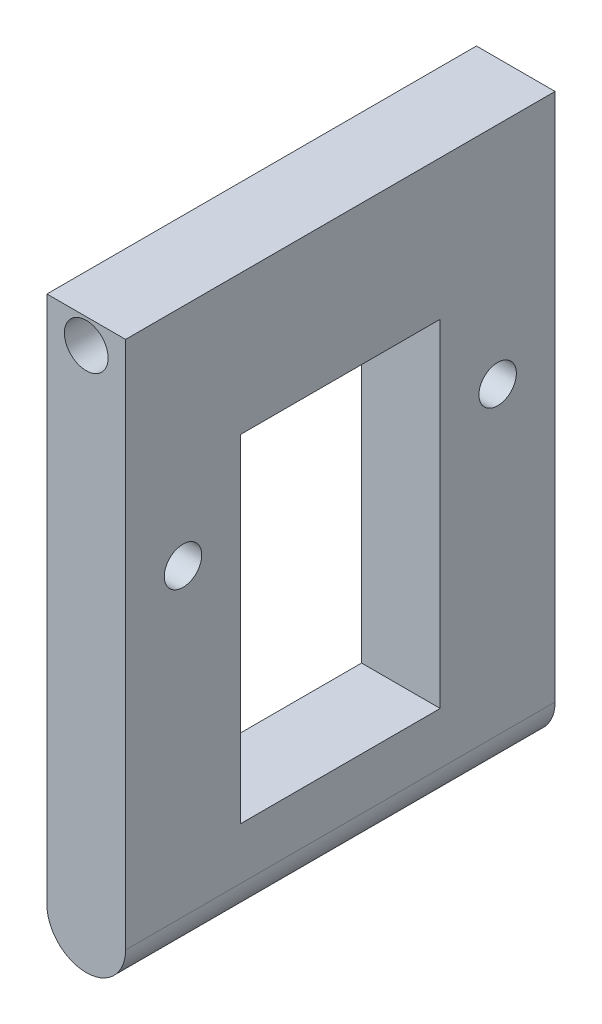
ISO-10303-21;
HEADER;
FILE_DESCRIPTION(('STEP AP214'),'2;1');
FILE_NAME('part.step','',(''),(''),'','','');
FILE_SCHEMA(('AUTOMOTIVE_DESIGN { 1 0 10303 214 1 1 1 1 }'));
ENDSEC;
DATA;
#1=APPLICATION_CONTEXT('core data for automotive mechanical design processes');
#2=APPLICATION_PROTOCOL_DEFINITION('international standard','automotive_design',2000,#1);
#3=PRODUCT_CONTEXT('',#1,'mechanical');
#4=PRODUCT('Part','Part','',(#3));
#5=PRODUCT_RELATED_PRODUCT_CATEGORY('part','',(#4));
#6=PRODUCT_DEFINITION_FORMATION('','',#4);
#7=PRODUCT_DEFINITION_CONTEXT('part definition',#1,'design');
#8=PRODUCT_DEFINITION('design','',#6,#7);
#9=PRODUCT_DEFINITION_SHAPE('','',#8);
#10=(LENGTH_UNIT() NAMED_UNIT(*) SI_UNIT(.MILLI.,.METRE.));
#11=(NAMED_UNIT(*) PLANE_ANGLE_UNIT() SI_UNIT($,.RADIAN.));
#12=(NAMED_UNIT(*) SI_UNIT($,.STERADIAN.) SOLID_ANGLE_UNIT());
#13=UNCERTAINTY_MEASURE_WITH_UNIT(LENGTH_MEASURE(1.E-05),#10,'distance_accuracy_value','');
#14=(GEOMETRIC_REPRESENTATION_CONTEXT(3) GLOBAL_UNCERTAINTY_ASSIGNED_CONTEXT((#13)) GLOBAL_UNIT_ASSIGNED_CONTEXT((#10,
#11,#12)) REPRESENTATION_CONTEXT('',''));
#15=CARTESIAN_POINT('',(0.,0.,0.));
#16=DIRECTION('',(0.,0.,1.));
#17=DIRECTION('',(1.,0.,0.));
#18=AXIS2_PLACEMENT_3D('',#15,#16,#17);
#19=CARTESIAN_POINT('',(3.15,-30.9323361823362,14.2108262108262));
#20=DIRECTION('',(0.,0.,-1.));
#21=DIRECTION('',(-1.,0.,0.));
#22=AXIS2_PLACEMENT_3D('',#19,#20,#21);
#23=CYLINDRICAL_SURFACE('',#22,3.15);
#24=DIRECTION('',(0.,0.,1.));
#25=VECTOR('',#24,1.);
#26=CARTESIAN_POINT('',(6.3,-30.9323361823362,14.2108262108262));
#27=LINE('',#26,#25);
#28=CARTESIAN_POINT('',(6.3,-30.9323361823362,14.2108262108262));
#29=VERTEX_POINT('',#28);
#30=CARTESIAN_POINT('',(6.3,-30.9323361823362,-20.1891737891738));
#31=VERTEX_POINT('',#30);
#32=EDGE_CURVE('E166',#29,#31,#27,.F.);
#33=ORIENTED_EDGE('',*,*,#32,.F.);
#34=CARTESIAN_POINT('',(3.15,-30.9323361823362,14.2108262108262));
#35=DIRECTION('',(0.,0.,-1.));
#36=DIRECTION('',(0.,1.,0.));
#37=AXIS2_PLACEMENT_3D('',#34,#35,#36);
#38=CIRCLE('',#37,3.15);
#39=CARTESIAN_POINT('',(0.,-30.9323361823362,14.2108262108262));
#40=VERTEX_POINT('',#39);
#41=EDGE_CURVE('E45',#40,#29,#38,.F.);
#42=ORIENTED_EDGE('',*,*,#41,.F.);
#43=DIRECTION('',(0.,0.,-1.));
#44=VECTOR('',#43,1.);
#45=CARTESIAN_POINT('',(0.,-30.9323361823362,0.));
#46=LINE('',#45,#44);
#47=CARTESIAN_POINT('',(0.,-30.9323361823362,-20.1891737891738));
#48=VERTEX_POINT('',#47);
#49=EDGE_CURVE('E171',#48,#40,#46,.F.);
#50=ORIENTED_EDGE('',*,*,#49,.F.);
#51=CARTESIAN_POINT('',(3.15,-30.9323361823362,-20.1891737891738));
#52=DIRECTION('',(0.,0.,1.));
#53=DIRECTION('',(0.,-1.,0.));
#54=AXIS2_PLACEMENT_3D('',#51,#52,#53);
#55=CIRCLE('',#54,3.15);
#56=EDGE_CURVE('E11',#31,#48,#55,.F.);
#57=ORIENTED_EDGE('',*,*,#56,.F.);
#58=EDGE_LOOP('',(#33,#42,#50,#57));
#59=FACE_BOUND('',#58,.T.);
#60=ADVANCED_FACE('F36',(#59),#23,.T.);
#61=CARTESIAN_POINT('',(6.3,11.4176638176638,14.2108262108262));
#62=DIRECTION('',(0.,0.,-1.));
#63=DIRECTION('',(0.,1.,0.));
#64=AXIS2_PLACEMENT_3D('',#61,#62,#63);
#65=PLANE('',#64);
#66=CARTESIAN_POINT('',(3.15,9.41766381766382,14.2108262108262));
#67=DIRECTION('',(0.,0.,1.));
#68=DIRECTION('',(1.,0.,0.));
#69=AXIS2_PLACEMENT_3D('',#66,#67,#68);
#70=CIRCLE('',#69,1.75);
#71=CARTESIAN_POINT('',(4.9,9.41766381766382,14.2108262108262));
#72=VERTEX_POINT('',#71);
#73=EDGE_CURVE('E130',#72,#72,#70,.T.);
#74=ORIENTED_EDGE('',*,*,#73,.F.);
#75=EDGE_LOOP('',(#74));
#76=FACE_BOUND('',#75,.T.);
#77=DIRECTION('',(0.,-1.,0.));
#78=VECTOR('',#77,1.);
#79=CARTESIAN_POINT('',(0.,11.4176638176638,14.2108262108262));
#80=LINE('',#79,#78);
#81=CARTESIAN_POINT('',(0.,11.4176638176638,14.2108262108262));
#82=VERTEX_POINT('',#81);
#83=EDGE_CURVE('E143',#82,#40,#80,.T.);
#84=ORIENTED_EDGE('',*,*,#83,.T.);
#85=ORIENTED_EDGE('',*,*,#41,.T.);
#86=DIRECTION('',(0.,-1.,0.));
#87=VECTOR('',#86,1.);
#88=CARTESIAN_POINT('',(6.3,11.4176638176638,14.2108262108262));
#89=LINE('',#88,#87);
#90=CARTESIAN_POINT('',(6.3,11.4176638176638,14.2108262108262));
#91=VERTEX_POINT('',#90);
#92=EDGE_CURVE('E147',#91,#29,#89,.T.);
#93=ORIENTED_EDGE('',*,*,#92,.F.);
#94=DIRECTION('',(-1.,0.,0.));
#95=VECTOR('',#94,1.);
#96=CARTESIAN_POINT('',(6.3,11.4176638176638,14.2108262108262));
#97=LINE('',#96,#95);
#98=EDGE_CURVE('E155',#91,#82,#97,.T.);
#99=ORIENTED_EDGE('',*,*,#98,.T.);
#100=EDGE_LOOP('',(#84,#85,#93,#99));
#101=FACE_BOUND('',#100,.T.);
#102=ADVANCED_FACE('F175',(#76,#101),#65,.F.);
#103=CARTESIAN_POINT('',(6.3,11.4176638176638,-20.1891737891738));
#104=DIRECTION('',(0.,0.,1.));
#105=DIRECTION('',(0.,-1.,0.));
#106=AXIS2_PLACEMENT_3D('',#103,#104,#105);
#107=PLANE('',#106);
#108=CARTESIAN_POINT('',(3.15,9.41766381766382,-20.1891737891738));
#109=DIRECTION('',(0.,0.,1.));
#110=DIRECTION('',(0.,-1.,0.));
#111=AXIS2_PLACEMENT_3D('',#108,#109,#110);
#112=CIRCLE('',#111,1.75);
#113=CARTESIAN_POINT('',(3.15,7.66766381766382,-20.1891737891738));
#114=VERTEX_POINT('',#113);
#115=EDGE_CURVE('E137',#114,#114,#112,.T.);
#116=ORIENTED_EDGE('',*,*,#115,.T.);
#117=EDGE_LOOP('',(#116));
#118=FACE_BOUND('',#117,.T.);
#119=DIRECTION('',(0.,1.,0.));
#120=VECTOR('',#119,1.);
#121=CARTESIAN_POINT('',(6.3,11.4176638176638,-20.1891737891738));
#122=LINE('',#121,#120);
#123=CARTESIAN_POINT('',(6.3,11.4176638176638,-20.1891737891738));
#124=VERTEX_POINT('',#123);
#125=EDGE_CURVE('E150',#31,#124,#122,.T.);
#126=ORIENTED_EDGE('',*,*,#125,.F.);
#127=ORIENTED_EDGE('',*,*,#56,.T.);
#128=DIRECTION('',(0.,1.,0.));
#129=VECTOR('',#128,1.);
#130=CARTESIAN_POINT('',(0.,11.4176638176638,-20.1891737891738));
#131=LINE('',#130,#129);
#132=CARTESIAN_POINT('',(0.,11.4176638176638,-20.1891737891738));
#133=VERTEX_POINT('',#132);
#134=EDGE_CURVE('E158',#48,#133,#131,.T.);
#135=ORIENTED_EDGE('',*,*,#134,.T.);
#136=DIRECTION('',(-1.,0.,0.));
#137=VECTOR('',#136,1.);
#138=CARTESIAN_POINT('',(6.3,11.4176638176638,-20.1891737891738));
#139=LINE('',#138,#137);
#140=EDGE_CURVE('E163',#124,#133,#139,.T.);
#141=ORIENTED_EDGE('',*,*,#140,.F.);
#142=EDGE_LOOP('',(#126,#127,#135,#141));
#143=FACE_BOUND('',#142,.T.);
#144=ADVANCED_FACE('F186',(#118,#143),#107,.F.);
#145=CARTESIAN_POINT('',(6.3,11.4176638176638,14.2108262108262));
#146=DIRECTION('',(0.,-1.,0.));
#147=DIRECTION('',(0.,0.,-1.));
#148=AXIS2_PLACEMENT_3D('',#145,#146,#147);
#149=PLANE('',#148);
#150=DIRECTION('',(0.,0.,1.));
#151=VECTOR('',#150,1.);
#152=CARTESIAN_POINT('',(0.,11.4176638176638,14.2108262108262));
#153=LINE('',#152,#151);
#154=EDGE_CURVE('E151',#133,#82,#153,.T.);
#155=ORIENTED_EDGE('',*,*,#154,.T.);
#156=ORIENTED_EDGE('',*,*,#98,.F.);
#157=DIRECTION('',(0.,0.,1.));
#158=VECTOR('',#157,1.);
#159=CARTESIAN_POINT('',(6.3,11.4176638176638,14.2108262108262));
#160=LINE('',#159,#158);
#161=EDGE_CURVE('E153',#124,#91,#160,.T.);
#162=ORIENTED_EDGE('',*,*,#161,.F.);
#163=ORIENTED_EDGE('',*,*,#140,.T.);
#164=EDGE_LOOP('',(#155,#156,#162,#163));
#165=FACE_BOUND('',#164,.T.);
#166=ADVANCED_FACE('F183',(#165),#149,.F.);
#167=CARTESIAN_POINT('',(6.3,0.,0.));
#168=DIRECTION('',(1.,0.,0.));
#169=DIRECTION('',(0.,0.,-1.));
#170=AXIS2_PLACEMENT_3D('',#167,#168,#169);
#171=PLANE('',#170);
#172=CARTESIAN_POINT('',(6.3,-6.58233618233618,-15.5891737891738));
#173=DIRECTION('',(1.,0.,0.));
#174=DIRECTION('',(0.,0.,-1.));
#175=AXIS2_PLACEMENT_3D('',#172,#173,#174);
#176=CIRCLE('',#175,1.5);
#177=CARTESIAN_POINT('',(6.3,-6.58233618233618,-17.0891737891738));
#178=VERTEX_POINT('',#177);
#179=EDGE_CURVE('E317',#178,#178,#176,.T.);
#180=ORIENTED_EDGE('',*,*,#179,.F.);
#181=EDGE_LOOP('',(#180));
#182=FACE_BOUND('',#181,.T.);
#183=CARTESIAN_POINT('',(6.3,-6.58233618233618,9.61082621082621));
#184=DIRECTION('',(1.,0.,0.));
#185=DIRECTION('',(0.,0.,-1.));
#186=AXIS2_PLACEMENT_3D('',#183,#184,#185);
#187=CIRCLE('',#186,1.5);
#188=CARTESIAN_POINT('',(6.3,-6.58233618233618,8.1108262108262));
#189=VERTEX_POINT('',#188);
#190=EDGE_CURVE('E313',#189,#189,#187,.T.);
#191=ORIENTED_EDGE('',*,*,#190,.F.);
#192=EDGE_LOOP('',(#191));
#193=FACE_BOUND('',#192,.T.);
#194=DIRECTION('',(0.,-1.,0.));
#195=VECTOR('',#194,1.);
#196=CARTESIAN_POINT('',(6.3,0.217663817663822,5.01082621082621));
#197=LINE('',#196,#195);
#198=CARTESIAN_POINT('',(6.3,0.217663817663822,5.01082621082621));
#199=VERTEX_POINT('',#198);
#200=CARTESIAN_POINT('',(6.3,-26.7823361823362,5.0108262108262));
#201=VERTEX_POINT('',#200);
#202=EDGE_CURVE('E106',#199,#201,#197,.T.);
#203=ORIENTED_EDGE('',*,*,#202,.F.);
#204=DIRECTION('',(0.,0.,1.));
#205=VECTOR('',#204,1.);
#206=CARTESIAN_POINT('',(6.3,0.217663817663822,5.01082621082621));
#207=LINE('',#206,#205);
#208=CARTESIAN_POINT('',(6.3,0.217663817663822,-10.9891737891738));
#209=VERTEX_POINT('',#208);
#210=EDGE_CURVE('E124',#209,#199,#207,.T.);
#211=ORIENTED_EDGE('',*,*,#210,.F.);
#212=DIRECTION('',(0.,1.,0.));
#213=VECTOR('',#212,1.);
#214=CARTESIAN_POINT('',(6.3,0.217663817663822,-10.9891737891738));
#215=LINE('',#214,#213);
#216=CARTESIAN_POINT('',(6.3,-26.7823361823362,-10.9891737891738));
#217=VERTEX_POINT('',#216);
#218=EDGE_CURVE('E127',#217,#209,#215,.T.);
#219=ORIENTED_EDGE('',*,*,#218,.F.);
#220=DIRECTION('',(0.,0.,-1.));
#221=VECTOR('',#220,1.);
#222=CARTESIAN_POINT('',(6.3,-26.7823361823362,5.0108262108262));
#223=LINE('',#222,#221);
#224=EDGE_CURVE('E136',#201,#217,#223,.T.);
#225=ORIENTED_EDGE('',*,*,#224,.F.);
#226=EDGE_LOOP('',(#203,#211,#219,#225));
#227=FACE_BOUND('',#226,.T.);
#228=ORIENTED_EDGE('',*,*,#92,.T.);
#229=ORIENTED_EDGE('',*,*,#32,.T.);
#230=ORIENTED_EDGE('',*,*,#125,.T.);
#231=ORIENTED_EDGE('',*,*,#161,.T.);
#232=EDGE_LOOP('',(#228,#229,#230,#231));
#233=FACE_BOUND('',#232,.T.);
#234=ADVANCED_FACE('F178',(#182,#193,#227,#233),#171,.T.);
#235=CARTESIAN_POINT('',(0.,0.,0.));
#236=DIRECTION('',(1.,0.,0.));
#237=DIRECTION('',(0.,0.,-1.));
#238=AXIS2_PLACEMENT_3D('',#235,#236,#237);
#239=PLANE('',#238);
#240=CARTESIAN_POINT('',(0.,-6.58233618233618,-15.5891737891738));
#241=DIRECTION('',(-1.,0.,0.));
#242=DIRECTION('',(0.,0.,1.));
#243=AXIS2_PLACEMENT_3D('',#240,#241,#242);
#244=CIRCLE('',#243,1.5);
#245=CARTESIAN_POINT('',(0.,-6.58233618233618,-14.0891737891738));
#246=VERTEX_POINT('',#245);
#247=EDGE_CURVE('E319',#246,#246,#244,.T.);
#248=ORIENTED_EDGE('',*,*,#247,.F.);
#249=EDGE_LOOP('',(#248));
#250=FACE_BOUND('',#249,.T.);
#251=CARTESIAN_POINT('',(0.,-6.58233618233618,9.61082621082621));
#252=DIRECTION('',(1.,0.,0.));
#253=DIRECTION('',(0.,0.,-1.));
#254=AXIS2_PLACEMENT_3D('',#251,#252,#253);
#255=CIRCLE('',#254,1.5);
#256=CARTESIAN_POINT('',(0.,-6.58233618233618,8.1108262108262));
#257=VERTEX_POINT('',#256);
#258=EDGE_CURVE('E40',#257,#257,#255,.T.);
#259=ORIENTED_EDGE('',*,*,#258,.T.);
#260=EDGE_LOOP('',(#259));
#261=FACE_BOUND('',#260,.T.);
#262=DIRECTION('',(0.,0.,1.));
#263=VECTOR('',#262,1.);
#264=CARTESIAN_POINT('',(0.,0.217663817663822,5.01082621082621));
#265=LINE('',#264,#263);
#266=CARTESIAN_POINT('',(0.,0.217663817663822,-10.9891737891738));
#267=VERTEX_POINT('',#266);
#268=CARTESIAN_POINT('',(0.,0.217663817663822,5.01082621082621));
#269=VERTEX_POINT('',#268);
#270=EDGE_CURVE('E111',#267,#269,#265,.T.);
#271=ORIENTED_EDGE('',*,*,#270,.T.);
#272=DIRECTION('',(0.,-1.,0.));
#273=VECTOR('',#272,1.);
#274=CARTESIAN_POINT('',(0.,0.217663817663822,5.01082621082621));
#275=LINE('',#274,#273);
#276=CARTESIAN_POINT('',(0.,-26.7823361823362,5.0108262108262));
#277=VERTEX_POINT('',#276);
#278=EDGE_CURVE('E103',#269,#277,#275,.T.);
#279=ORIENTED_EDGE('',*,*,#278,.T.);
#280=DIRECTION('',(0.,0.,-1.));
#281=VECTOR('',#280,1.);
#282=CARTESIAN_POINT('',(0.,-26.7823361823362,5.0108262108262));
#283=LINE('',#282,#281);
#284=CARTESIAN_POINT('',(0.,-26.7823361823362,-10.9891737891738));
#285=VERTEX_POINT('',#284);
#286=EDGE_CURVE('E115',#277,#285,#283,.T.);
#287=ORIENTED_EDGE('',*,*,#286,.T.);
#288=DIRECTION('',(0.,1.,0.));
#289=VECTOR('',#288,1.);
#290=CARTESIAN_POINT('',(0.,0.217663817663822,-10.9891737891738));
#291=LINE('',#290,#289);
#292=EDGE_CURVE('E119',#285,#267,#291,.T.);
#293=ORIENTED_EDGE('',*,*,#292,.T.);
#294=EDGE_LOOP('',(#271,#279,#287,#293));
#295=FACE_BOUND('',#294,.T.);
#296=ORIENTED_EDGE('',*,*,#134,.F.);
#297=ORIENTED_EDGE('',*,*,#49,.T.);
#298=ORIENTED_EDGE('',*,*,#83,.F.);
#299=ORIENTED_EDGE('',*,*,#154,.F.);
#300=EDGE_LOOP('',(#296,#297,#298,#299));
#301=FACE_BOUND('',#300,.T.);
#302=ADVANCED_FACE('F121',(#250,#261,#295,#301),#239,.F.);
#303=CARTESIAN_POINT('',(0.,0.217663817663822,5.01082621082621));
#304=DIRECTION('',(0.,0.,1.));
#305=DIRECTION('',(0.,-1.,0.));
#306=AXIS2_PLACEMENT_3D('',#303,#304,#305);
#307=PLANE('',#306);
#308=ORIENTED_EDGE('',*,*,#202,.T.);
#309=DIRECTION('',(1.,0.,0.));
#310=VECTOR('',#309,1.);
#311=CARTESIAN_POINT('',(0.,-26.7823361823362,5.0108262108262));
#312=LINE('',#311,#310);
#313=EDGE_CURVE('E99',#277,#201,#312,.T.);
#314=ORIENTED_EDGE('',*,*,#313,.F.);
#315=ORIENTED_EDGE('',*,*,#278,.F.);
#316=DIRECTION('',(1.,0.,0.));
#317=VECTOR('',#316,1.);
#318=CARTESIAN_POINT('',(0.,0.217663817663822,5.01082621082621));
#319=LINE('',#318,#317);
#320=EDGE_CURVE('E141',#269,#199,#319,.T.);
#321=ORIENTED_EDGE('',*,*,#320,.T.);
#322=EDGE_LOOP('',(#308,#314,#315,#321));
#323=FACE_BOUND('',#322,.T.);
#324=ADVANCED_FACE('F101',(#323),#307,.F.);
#325=CARTESIAN_POINT('',(0.,0.217663817663822,5.01082621082621));
#326=DIRECTION('',(0.,1.,0.));
#327=DIRECTION('',(0.,0.,1.));
#328=AXIS2_PLACEMENT_3D('',#325,#326,#327);
#329=PLANE('',#328);
#330=ORIENTED_EDGE('',*,*,#210,.T.);
#331=ORIENTED_EDGE('',*,*,#320,.F.);
#332=ORIENTED_EDGE('',*,*,#270,.F.);
#333=DIRECTION('',(1.,0.,0.));
#334=VECTOR('',#333,1.);
#335=CARTESIAN_POINT('',(0.,0.217663817663822,-10.9891737891738));
#336=LINE('',#335,#334);
#337=EDGE_CURVE('E144',#267,#209,#336,.T.);
#338=ORIENTED_EDGE('',*,*,#337,.T.);
#339=EDGE_LOOP('',(#330,#331,#332,#338));
#340=FACE_BOUND('',#339,.T.);
#341=ADVANCED_FACE('F255',(#340),#329,.F.);
#342=CARTESIAN_POINT('',(0.,0.217663817663822,-10.9891737891738));
#343=DIRECTION('',(0.,0.,-1.));
#344=DIRECTION('',(0.,1.,0.));
#345=AXIS2_PLACEMENT_3D('',#342,#343,#344);
#346=PLANE('',#345);
#347=ORIENTED_EDGE('',*,*,#218,.T.);
#348=ORIENTED_EDGE('',*,*,#337,.F.);
#349=ORIENTED_EDGE('',*,*,#292,.F.);
#350=DIRECTION('',(1.,0.,0.));
#351=VECTOR('',#350,1.);
#352=CARTESIAN_POINT('',(0.,-26.7823361823362,-10.9891737891738));
#353=LINE('',#352,#351);
#354=EDGE_CURVE('E110',#285,#217,#353,.T.);
#355=ORIENTED_EDGE('',*,*,#354,.T.);
#356=EDGE_LOOP('',(#347,#348,#349,#355));
#357=FACE_BOUND('',#356,.T.);
#358=ADVANCED_FACE('F258',(#357),#346,.F.);
#359=CARTESIAN_POINT('',(0.,-26.7823361823362,5.0108262108262));
#360=DIRECTION('',(0.,-1.,0.));
#361=DIRECTION('',(0.,0.,-1.));
#362=AXIS2_PLACEMENT_3D('',#359,#360,#361);
#363=PLANE('',#362);
#364=ORIENTED_EDGE('',*,*,#224,.T.);
#365=ORIENTED_EDGE('',*,*,#354,.F.);
#366=ORIENTED_EDGE('',*,*,#286,.F.);
#367=ORIENTED_EDGE('',*,*,#313,.T.);
#368=EDGE_LOOP('',(#364,#365,#366,#367));
#369=FACE_BOUND('',#368,.T.);
#370=ADVANCED_FACE('F116',(#369),#363,.F.);
#371=CARTESIAN_POINT('',(3.15,9.41766381766382,-26.0891737891738));
#372=DIRECTION('',(0.,0.,1.));
#373=DIRECTION('',(1.,0.,0.));
#374=AXIS2_PLACEMENT_3D('',#371,#372,#373);
#375=CYLINDRICAL_SURFACE('',#374,1.75);
#376=ORIENTED_EDGE('',*,*,#73,.T.);
#377=EDGE_LOOP('',(#376));
#378=FACE_BOUND('',#377,.T.);
#379=ORIENTED_EDGE('',*,*,#115,.F.);
#380=EDGE_LOOP('',(#379));
#381=FACE_BOUND('',#380,.T.);
#382=ADVANCED_FACE('F220',(#378,#381),#375,.F.);
#383=CARTESIAN_POINT('',(-34.,-6.58233618233618,9.61082621082621));
#384=DIRECTION('',(1.,0.,0.));
#385=DIRECTION('',(0.,0.,-1.));
#386=AXIS2_PLACEMENT_3D('',#383,#384,#385);
#387=CYLINDRICAL_SURFACE('',#386,1.5);
#388=ORIENTED_EDGE('',*,*,#190,.T.);
#389=EDGE_LOOP('',(#388));
#390=FACE_BOUND('',#389,.T.);
#391=ORIENTED_EDGE('',*,*,#258,.F.);
#392=EDGE_LOOP('',(#391));
#393=FACE_BOUND('',#392,.T.);
#394=ADVANCED_FACE('F214',(#390,#393),#387,.F.);
#395=CARTESIAN_POINT('',(40.3,-6.58233618233618,-15.5891737891738));
#396=DIRECTION('',(-1.,0.,0.));
#397=DIRECTION('',(0.,0.,1.));
#398=AXIS2_PLACEMENT_3D('',#395,#396,#397);
#399=CYLINDRICAL_SURFACE('',#398,1.5);
#400=ORIENTED_EDGE('',*,*,#179,.T.);
#401=EDGE_LOOP('',(#400));
#402=FACE_BOUND('',#401,.T.);
#403=ORIENTED_EDGE('',*,*,#247,.T.);
#404=EDGE_LOOP('',(#403));
#405=FACE_BOUND('',#404,.T.);
#406=ADVANCED_FACE('F219',(#402,#405),#399,.F.);
#407=CLOSED_SHELL('',(#60,#102,#144,#166,#234,#302,#324,#341,#358,#370,#382,#394,#406));
#408=MANIFOLD_SOLID_BREP('B2',#407);
#409=ADVANCED_BREP_SHAPE_REPRESENTATION('',(#18,#408),#14);
#410=SHAPE_DEFINITION_REPRESENTATION(#9,#409);
ENDSEC;
END-ISO-10303-21;
